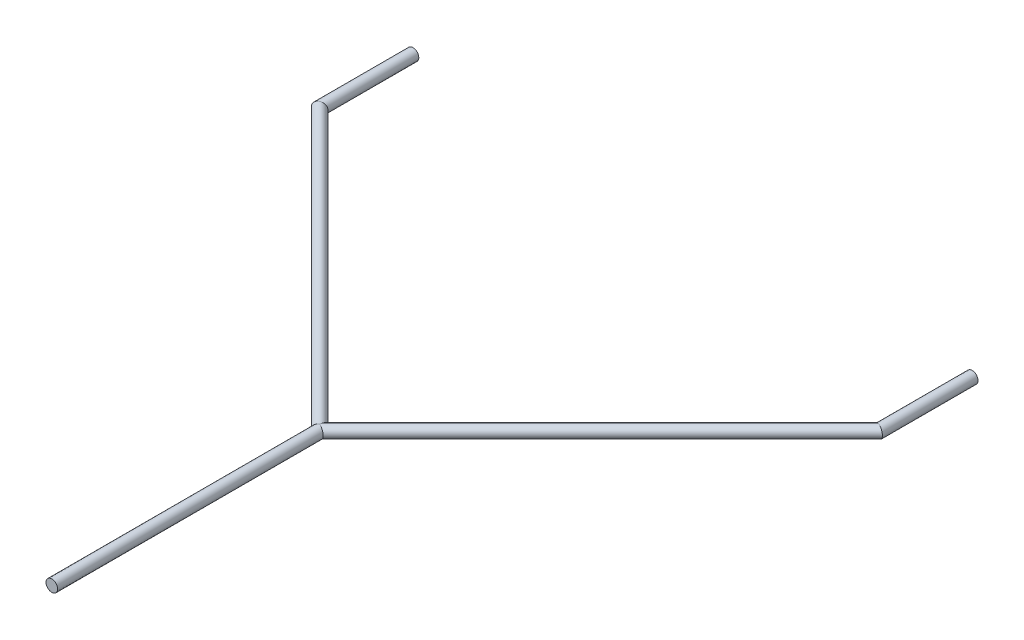
ISO-10303-21;
HEADER;
FILE_DESCRIPTION(('STEP AP214'),'2;1');
FILE_NAME('part.step','',(''),(''),'','','');
FILE_SCHEMA(('AUTOMOTIVE_DESIGN { 1 0 10303 214 1 1 1 1 }'));
ENDSEC;
DATA;
#1=APPLICATION_CONTEXT('core data for automotive mechanical design processes');
#2=APPLICATION_PROTOCOL_DEFINITION('international standard','automotive_design',2000,#1);
#3=PRODUCT_CONTEXT('',#1,'mechanical');
#4=PRODUCT('Part','Part','',(#3));
#5=PRODUCT_RELATED_PRODUCT_CATEGORY('part','',(#4));
#6=PRODUCT_DEFINITION_FORMATION('','',#4);
#7=PRODUCT_DEFINITION_CONTEXT('part definition',#1,'design');
#8=PRODUCT_DEFINITION('design','',#6,#7);
#9=PRODUCT_DEFINITION_SHAPE('','',#8);
#10=(LENGTH_UNIT() NAMED_UNIT(*) SI_UNIT(.MILLI.,.METRE.));
#11=(NAMED_UNIT(*) PLANE_ANGLE_UNIT() SI_UNIT($,.RADIAN.));
#12=(NAMED_UNIT(*) SI_UNIT($,.STERADIAN.) SOLID_ANGLE_UNIT());
#13=UNCERTAINTY_MEASURE_WITH_UNIT(LENGTH_MEASURE(1.E-05),#10,'distance_accuracy_value','');
#14=(GEOMETRIC_REPRESENTATION_CONTEXT(3) GLOBAL_UNCERTAINTY_ASSIGNED_CONTEXT((#13)) GLOBAL_UNIT_ASSIGNED_CONTEXT((#10,
#11,#12)) REPRESENTATION_CONTEXT('',''));
#15=CARTESIAN_POINT('',(0.,0.,0.));
#16=DIRECTION('',(0.,0.,1.));
#17=DIRECTION('',(1.,0.,0.));
#18=AXIS2_PLACEMENT_3D('',#15,#16,#17);
#19=CARTESIAN_POINT('',(76.2,0.,-174.625));
#20=DIRECTION('',(0.,0.,1.));
#21=DIRECTION('',(1.,0.,0.));
#22=AXIS2_PLACEMENT_3D('',#19,#20,#21);
#23=PLANE('',#22);
#24=CARTESIAN_POINT('',(76.2,0.,-174.625));
#25=DIRECTION('',(0.,0.,1.));
#26=DIRECTION('',(1.,0.,0.));
#27=AXIS2_PLACEMENT_3D('',#24,#25,#26);
#28=CIRCLE('',#27,1.5875);
#29=CARTESIAN_POINT('',(77.7875000000001,0.,-174.625));
#30=VERTEX_POINT('',#29);
#31=EDGE_CURVE('E62',#30,#30,#28,.T.);
#32=ORIENTED_EDGE('',*,*,#31,.F.);
#33=EDGE_LOOP('',(#32));
#34=FACE_BOUND('',#33,.T.);
#35=ADVANCED_FACE('F39',(#34),#23,.F.);
#36=CARTESIAN_POINT('',(0.,0.,0.));
#37=DIRECTION('',(0.,0.,1.));
#38=DIRECTION('',(1.,0.,0.));
#39=AXIS2_PLACEMENT_3D('',#36,#37,#38);
#40=PLANE('',#39);
#41=CARTESIAN_POINT('',(0.,0.,0.));
#42=DIRECTION('',(0.,0.,1.));
#43=DIRECTION('',(1.,0.,0.));
#44=AXIS2_PLACEMENT_3D('',#41,#42,#43);
#45=CIRCLE('',#44,1.5875);
#46=CARTESIAN_POINT('',(1.5875,0.,0.));
#47=VERTEX_POINT('',#46);
#48=EDGE_CURVE('E67',#47,#47,#45,.T.);
#49=ORIENTED_EDGE('',*,*,#48,.T.);
#50=EDGE_LOOP('',(#49));
#51=FACE_BOUND('',#50,.T.);
#52=ADVANCED_FACE('F83',(#51),#40,.T.);
#53=CARTESIAN_POINT('',(76.2,0.,-148.401679566706));
#54=DIRECTION('',(0.,0.,-1.));
#55=DIRECTION('',(-1.,0.,0.));
#56=AXIS2_PLACEMENT_3D('',#53,#54,#55);
#57=CYLINDRICAL_SURFACE('',#56,1.5875);
#58=CARTESIAN_POINT('',(76.2,0.,-149.225));
#59=DIRECTION('',(0.38268343236509,0.,-0.923879532511287));
#60=DIRECTION('',(0.923879532511287,0.,0.38268343236509));
#61=AXIS2_PLACEMENT_3D('',#58,#59,#60);
#62=ELLIPSE('',#61,1.71829761796417,1.5875);
#63=CARTESIAN_POINT('',(77.7875,0.,-148.567435969733));
#64=VERTEX_POINT('',#63);
#65=EDGE_CURVE('E71',#64,#64,#62,.T.);
#66=ORIENTED_EDGE('',*,*,#65,.T.);
#67=EDGE_LOOP('',(#66));
#68=FACE_BOUND('',#67,.T.);
#69=ORIENTED_EDGE('',*,*,#31,.T.);
#70=EDGE_LOOP('',(#69));
#71=FACE_BOUND('',#70,.T.);
#72=ADVANCED_FACE('F80',(#68,#71),#57,.T.);
#73=CARTESIAN_POINT('',(-0.582175461471659,0.,-72.4428245385284));
#74=DIRECTION('',(0.707106781186548,0.,-0.707106781186547));
#75=DIRECTION('',(-0.707106781186547,0.,-0.707106781186548));
#76=AXIS2_PLACEMENT_3D('',#73,#74,#75);
#77=CYLINDRICAL_SURFACE('',#76,1.5875);
#78=CARTESIAN_POINT('',(0.,0.,-73.025));
#79=DIRECTION('',(0.38268343236509,0.,-0.923879532511287));
#80=DIRECTION('',(-0.923879532511287,0.,-0.38268343236509));
#81=AXIS2_PLACEMENT_3D('',#78,#79,#80);
#82=ELLIPSE('',#81,1.71829761796418,1.5875);
#83=CARTESIAN_POINT('',(1.9045296709816E-13,1.5875,-73.0250000000002));
#84=VERTEX_POINT('',#83);
#85=CARTESIAN_POINT('',(-1.51035909774728E-13,-1.5875,-73.0250000000001));
#86=VERTEX_POINT('',#85);
#87=EDGE_CURVE('E47',#84,#86,#82,.T.);
#88=ORIENTED_EDGE('',*,*,#87,.T.);
#89=CARTESIAN_POINT('',(0.,0.,-73.025));
#90=DIRECTION('',(1.,0.,0.));
#91=DIRECTION('',(0.,0.,-1.));
#92=AXIS2_PLACEMENT_3D('',#89,#90,#91);
#93=ELLIPSE('',#92,2.24506403026729,1.5875);
#94=EDGE_CURVE('E53',#86,#84,#93,.T.);
#95=ORIENTED_EDGE('',*,*,#94,.T.);
#96=EDGE_LOOP('',(#88,#95));
#97=FACE_BOUND('',#96,.T.);
#98=ORIENTED_EDGE('',*,*,#65,.F.);
#99=EDGE_LOOP('',(#98));
#100=FACE_BOUND('',#99,.T.);
#101=ADVANCED_FACE('F59',(#97,#100),#77,.T.);
#102=CARTESIAN_POINT('',(0.,0.,0.));
#103=DIRECTION('',(0.,0.,-1.));
#104=DIRECTION('',(-1.,0.,0.));
#105=AXIS2_PLACEMENT_3D('',#102,#103,#104);
#106=CYLINDRICAL_SURFACE('',#105,1.5875);
#107=ORIENTED_EDGE('',*,*,#48,.F.);
#108=EDGE_LOOP('',(#107));
#109=FACE_BOUND('',#108,.T.);
#110=ORIENTED_EDGE('',*,*,#87,.F.);
#111=CARTESIAN_POINT('',(0.,0.,-73.0250000000001));
#112=DIRECTION('',(-0.38268343236509,0.,-0.923879532511287));
#113=DIRECTION('',(0.923879532511287,0.,-0.38268343236509));
#114=AXIS2_PLACEMENT_3D('',#111,#112,#113);
#115=ELLIPSE('',#114,1.71829761796417,1.5875);
#116=EDGE_CURVE('E11',#84,#86,#115,.F.);
#117=ORIENTED_EDGE('',*,*,#116,.T.);
#118=EDGE_LOOP('',(#110,#117));
#119=FACE_BOUND('',#118,.T.);
#120=ADVANCED_FACE('F65',(#109,#119),#106,.T.);
#121=CARTESIAN_POINT('',(-76.7821754614717,0.,-149.807175461472));
#122=DIRECTION('',(0.707106781186548,0.,0.707106781186547));
#123=DIRECTION('',(0.707106781186547,0.,-0.707106781186548));
#124=AXIS2_PLACEMENT_3D('',#121,#122,#123);
#125=CYLINDRICAL_SURFACE('',#124,1.5875);
#126=CARTESIAN_POINT('',(-76.2,0.,-149.225));
#127=DIRECTION('',(0.38268343236509,0.,0.923879532511287));
#128=DIRECTION('',(-0.923879532511287,0.,0.38268343236509));
#129=AXIS2_PLACEMENT_3D('',#126,#127,#128);
#130=ELLIPSE('',#129,1.71829761796417,1.5875);
#131=CARTESIAN_POINT('',(-77.7875,0.,-148.567435969733));
#132=VERTEX_POINT('',#131);
#133=EDGE_CURVE('E63',#132,#132,#130,.F.);
#134=ORIENTED_EDGE('',*,*,#133,.F.);
#135=EDGE_LOOP('',(#134));
#136=FACE_BOUND('',#135,.T.);
#137=ORIENTED_EDGE('',*,*,#94,.F.);
#138=ORIENTED_EDGE('',*,*,#116,.F.);
#139=EDGE_LOOP('',(#137,#138));
#140=FACE_BOUND('',#139,.T.);
#141=ADVANCED_FACE('F54',(#136,#140),#125,.T.);
#142=CARTESIAN_POINT('',(-76.2,0.,-174.625));
#143=DIRECTION('',(0.,0.,1.));
#144=DIRECTION('',(1.,0.,0.));
#145=AXIS2_PLACEMENT_3D('',#142,#143,#144);
#146=PLANE('',#145);
#147=CARTESIAN_POINT('',(-76.2,0.,-174.625));
#148=DIRECTION('',(0.,0.,1.));
#149=DIRECTION('',(1.,0.,0.));
#150=AXIS2_PLACEMENT_3D('',#147,#148,#149);
#151=CIRCLE('',#150,1.5875);
#152=CARTESIAN_POINT('',(-74.6125,0.,-174.625));
#153=VERTEX_POINT('',#152);
#154=EDGE_CURVE('E148',#153,#153,#151,.T.);
#155=ORIENTED_EDGE('',*,*,#154,.F.);
#156=EDGE_LOOP('',(#155));
#157=FACE_BOUND('',#156,.T.);
#158=ADVANCED_FACE('F89',(#157),#146,.F.);
#159=CARTESIAN_POINT('',(-76.2,0.,-174.625));
#160=DIRECTION('',(0.,0.,1.));
#161=DIRECTION('',(1.,0.,0.));
#162=AXIS2_PLACEMENT_3D('',#159,#160,#161);
#163=CYLINDRICAL_SURFACE('',#162,1.5875);
#164=ORIENTED_EDGE('',*,*,#154,.T.);
#165=EDGE_LOOP('',(#164));
#166=FACE_BOUND('',#165,.T.);
#167=ORIENTED_EDGE('',*,*,#133,.T.);
#168=EDGE_LOOP('',(#167));
#169=FACE_BOUND('',#168,.T.);
#170=ADVANCED_FACE('F92',(#166,#169),#163,.T.);
#171=CLOSED_SHELL('',(#35,#52,#72,#101,#120,#141,#158,#170));
#172=MANIFOLD_SOLID_BREP('B2',#171);
#173=ADVANCED_BREP_SHAPE_REPRESENTATION('',(#18,#172),#14);
#174=SHAPE_DEFINITION_REPRESENTATION(#9,#173);
ENDSEC;
END-ISO-10303-21;
